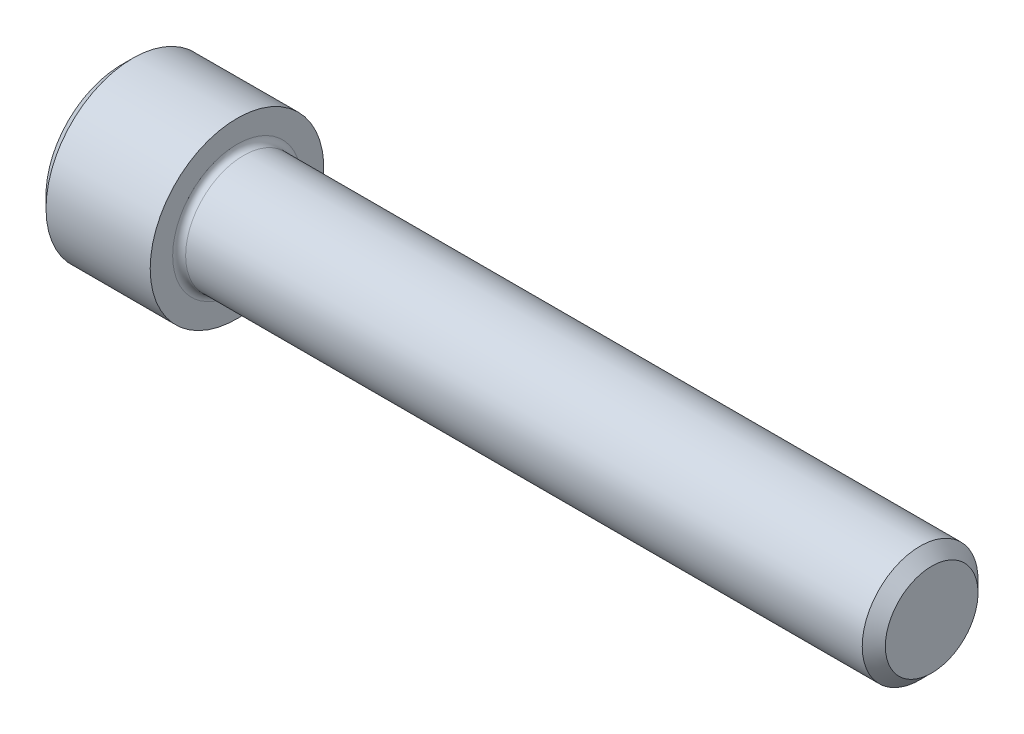
ISO-10303-21;
HEADER;
FILE_DESCRIPTION(('STEP AP214'),'2;1');
FILE_NAME('part.step','',(''),(''),'','','');
FILE_SCHEMA(('AUTOMOTIVE_DESIGN { 1 0 10303 214 1 1 1 1 }'));
ENDSEC;
DATA;
#1=APPLICATION_CONTEXT('core data for automotive mechanical design processes');
#2=APPLICATION_PROTOCOL_DEFINITION('international standard','automotive_design',2000,#1);
#3=PRODUCT_CONTEXT('',#1,'mechanical');
#4=PRODUCT('Part','Part','',(#3));
#5=PRODUCT_RELATED_PRODUCT_CATEGORY('part','',(#4));
#6=PRODUCT_DEFINITION_FORMATION('','',#4);
#7=PRODUCT_DEFINITION_CONTEXT('part definition',#1,'design');
#8=PRODUCT_DEFINITION('design','',#6,#7);
#9=PRODUCT_DEFINITION_SHAPE('','',#8);
#10=(LENGTH_UNIT() NAMED_UNIT(*) SI_UNIT(.MILLI.,.METRE.));
#11=(NAMED_UNIT(*) PLANE_ANGLE_UNIT() SI_UNIT($,.RADIAN.));
#12=(NAMED_UNIT(*) SI_UNIT($,.STERADIAN.) SOLID_ANGLE_UNIT());
#13=UNCERTAINTY_MEASURE_WITH_UNIT(LENGTH_MEASURE(1.E-05),#10,'distance_accuracy_value','');
#14=(GEOMETRIC_REPRESENTATION_CONTEXT(3) GLOBAL_UNCERTAINTY_ASSIGNED_CONTEXT((#13)) GLOBAL_UNIT_ASSIGNED_CONTEXT((#10,
#11,#12)) REPRESENTATION_CONTEXT('',''));
#15=CARTESIAN_POINT('',(0.,0.,0.));
#16=DIRECTION('',(0.,0.,1.));
#17=DIRECTION('',(1.,0.,0.));
#18=AXIS2_PLACEMENT_3D('',#15,#16,#17);
#19=CARTESIAN_POINT('',(3.048,4.12444598552338,-2.38125));
#20=DIRECTION('',(1.,0.,0.));
#21=DIRECTION('',(0.,0.,-1.));
#22=AXIS2_PLACEMENT_3D('',#19,#20,#21);
#23=PLANE('',#22);
#24=DIRECTION('',(0.,1.,0.));
#25=VECTOR('',#24,1.);
#26=CARTESIAN_POINT('',(3.048,4.12444598552338,2.38125));
#27=LINE('',#26,#25);
#28=CARTESIAN_POINT('',(3.04800000000343,0.,2.38124999992517));
#29=VERTEX_POINT('',#28);
#30=CARTESIAN_POINT('',(3.048,-1.37481532850779,2.38125));
#31=VERTEX_POINT('',#30);
#32=EDGE_CURVE('E95',#29,#31,#27,.F.);
#33=ORIENTED_EDGE('',*,*,#32,.F.);
#34=CARTESIAN_POINT('',(3.04799999996081,0.,0.));
#35=DIRECTION('',(-1.,0.,0.));
#36=DIRECTION('',(0.,-1.,0.));
#37=AXIS2_PLACEMENT_3D('',#34,#35,#36);
#38=CIRCLE('',#37,2.38124999992806);
#39=CARTESIAN_POINT('',(3.04799999998041,-2.06222299273054,1.19062499998202));
#40=VERTEX_POINT('',#39);
#41=EDGE_CURVE('E97',#29,#40,#38,.F.);
#42=ORIENTED_EDGE('',*,*,#41,.T.);
#43=DIRECTION('',(0.,-0.500000000000001,-0.866025403784438));
#44=VECTOR('',#43,1.);
#45=CARTESIAN_POINT('',(3.048,-1.37481532850779,2.38125));
#46=LINE('',#45,#44);
#47=EDGE_CURVE('E100',#31,#40,#46,.T.);
#48=ORIENTED_EDGE('',*,*,#47,.F.);
#49=EDGE_LOOP('',(#33,#42,#48));
#50=FACE_BOUND('',#49,.T.);
#51=ADVANCED_FACE('F16',(#50),#23,.F.);
#52=CARTESIAN_POINT('',(3.048,4.12444598552338,-2.38125));
#53=DIRECTION('',(1.,0.,0.));
#54=DIRECTION('',(0.,0.,-1.));
#55=AXIS2_PLACEMENT_3D('',#52,#53,#54);
#56=PLANE('',#55);
#57=DIRECTION('',(0.,-0.500000000000001,-0.866025403784438));
#58=VECTOR('',#57,1.);
#59=CARTESIAN_POINT('',(3.048,-2.06222299276169,1.190625));
#60=LINE('',#59,#58);
#61=CARTESIAN_POINT('',(3.048,-2.74963065701559,0.));
#62=VERTEX_POINT('',#61);
#63=EDGE_CURVE('E168',#40,#62,#60,.T.);
#64=ORIENTED_EDGE('',*,*,#63,.F.);
#65=CARTESIAN_POINT('',(3.04799999996081,0.,0.));
#66=DIRECTION('',(-1.,0.,0.));
#67=DIRECTION('',(0.,-1.,0.));
#68=AXIS2_PLACEMENT_3D('',#65,#66,#67);
#69=CIRCLE('',#68,2.38124999992806);
#70=CARTESIAN_POINT('',(3.04799999998041,-2.06222299273054,-1.19062499998201));
#71=VERTEX_POINT('',#70);
#72=EDGE_CURVE('E115',#40,#71,#69,.F.);
#73=ORIENTED_EDGE('',*,*,#72,.T.);
#74=DIRECTION('',(0.,0.499999999999998,-0.86602540378444));
#75=VECTOR('',#74,1.);
#76=CARTESIAN_POINT('',(3.048,-2.74963065701559,0.));
#77=LINE('',#76,#75);
#78=EDGE_CURVE('E164',#62,#71,#77,.T.);
#79=ORIENTED_EDGE('',*,*,#78,.F.);
#80=EDGE_LOOP('',(#64,#73,#79));
#81=FACE_BOUND('',#80,.T.);
#82=ADVANCED_FACE('F340',(#81),#56,.F.);
#83=CARTESIAN_POINT('',(3.048,4.12444598552338,-2.38125));
#84=DIRECTION('',(1.,0.,0.));
#85=DIRECTION('',(0.,0.,-1.));
#86=AXIS2_PLACEMENT_3D('',#83,#84,#85);
#87=PLANE('',#86);
#88=DIRECTION('',(0.,0.499999999999998,-0.86602540378444));
#89=VECTOR('',#88,1.);
#90=CARTESIAN_POINT('',(3.048,-2.06222299276169,-1.19062499999999));
#91=LINE('',#90,#89);
#92=CARTESIAN_POINT('',(3.048,-1.3748153285078,-2.38125));
#93=VERTEX_POINT('',#92);
#94=EDGE_CURVE('E160',#71,#93,#91,.T.);
#95=ORIENTED_EDGE('',*,*,#94,.F.);
#96=CARTESIAN_POINT('',(3.04799999996081,0.,0.));
#97=DIRECTION('',(-1.,0.,0.));
#98=DIRECTION('',(0.,-1.,0.));
#99=AXIS2_PLACEMENT_3D('',#96,#97,#98);
#100=CIRCLE('',#99,2.38124999992806);
#101=CARTESIAN_POINT('',(3.04800000000343,0.,-2.38124999992517));
#102=VERTEX_POINT('',#101);
#103=EDGE_CURVE('E217',#71,#102,#100,.F.);
#104=ORIENTED_EDGE('',*,*,#103,.T.);
#105=DIRECTION('',(0.,1.,0.));
#106=VECTOR('',#105,1.);
#107=CARTESIAN_POINT('',(3.048,4.12444598552338,-2.38125));
#108=LINE('',#107,#106);
#109=EDGE_CURVE('E156',#93,#102,#108,.T.);
#110=ORIENTED_EDGE('',*,*,#109,.F.);
#111=EDGE_LOOP('',(#95,#104,#110));
#112=FACE_BOUND('',#111,.T.);
#113=ADVANCED_FACE('F337',(#112),#87,.F.);
#114=CARTESIAN_POINT('',(3.048,4.12444598552338,-2.38125));
#115=DIRECTION('',(1.,0.,0.));
#116=DIRECTION('',(0.,0.,-1.));
#117=AXIS2_PLACEMENT_3D('',#114,#115,#116);
#118=PLANE('',#117);
#119=DIRECTION('',(0.,1.,0.));
#120=VECTOR('',#119,1.);
#121=CARTESIAN_POINT('',(3.048,4.12444598552338,-2.38125));
#122=LINE('',#121,#120);
#123=CARTESIAN_POINT('',(3.048,1.37481532850779,-2.38125));
#124=VERTEX_POINT('',#123);
#125=EDGE_CURVE('E152',#102,#124,#122,.T.);
#126=ORIENTED_EDGE('',*,*,#125,.F.);
#127=CARTESIAN_POINT('',(3.04799999996081,0.,0.));
#128=DIRECTION('',(-1.,0.,0.));
#129=DIRECTION('',(0.,-1.,0.));
#130=AXIS2_PLACEMENT_3D('',#127,#128,#129);
#131=CIRCLE('',#130,2.38124999992806);
#132=CARTESIAN_POINT('',(3.04799999998041,2.06222299273054,-1.19062499998202));
#133=VERTEX_POINT('',#132);
#134=EDGE_CURVE('E214',#102,#133,#131,.F.);
#135=ORIENTED_EDGE('',*,*,#134,.T.);
#136=DIRECTION('',(0.,0.500000000000001,0.866025403784438));
#137=VECTOR('',#136,1.);
#138=CARTESIAN_POINT('',(3.048,1.37481532850779,-2.38125));
#139=LINE('',#138,#137);
#140=EDGE_CURVE('E148',#124,#133,#139,.T.);
#141=ORIENTED_EDGE('',*,*,#140,.F.);
#142=EDGE_LOOP('',(#126,#135,#141));
#143=FACE_BOUND('',#142,.T.);
#144=ADVANCED_FACE('F333',(#143),#118,.F.);
#145=CARTESIAN_POINT('',(3.048,4.12444598552338,-2.38125));
#146=DIRECTION('',(1.,0.,0.));
#147=DIRECTION('',(0.,0.,-1.));
#148=AXIS2_PLACEMENT_3D('',#145,#146,#147);
#149=PLANE('',#148);
#150=DIRECTION('',(0.,0.500000000000001,0.866025403784438));
#151=VECTOR('',#150,1.);
#152=CARTESIAN_POINT('',(3.048,2.06222299276169,-1.190625));
#153=LINE('',#152,#151);
#154=CARTESIAN_POINT('',(3.048,2.74963065701559,0.));
#155=VERTEX_POINT('',#154);
#156=EDGE_CURVE('E144',#133,#155,#153,.T.);
#157=ORIENTED_EDGE('',*,*,#156,.F.);
#158=CARTESIAN_POINT('',(3.04799999996081,0.,0.));
#159=DIRECTION('',(-1.,0.,0.));
#160=DIRECTION('',(0.,-1.,0.));
#161=AXIS2_PLACEMENT_3D('',#158,#159,#160);
#162=CIRCLE('',#161,2.38124999992806);
#163=CARTESIAN_POINT('',(3.04799999998041,2.06222299273055,1.19062499998201));
#164=VERTEX_POINT('',#163);
#165=EDGE_CURVE('E123',#133,#164,#162,.F.);
#166=ORIENTED_EDGE('',*,*,#165,.T.);
#167=DIRECTION('',(0.,-0.499999999999998,0.86602540378444));
#168=VECTOR('',#167,1.);
#169=CARTESIAN_POINT('',(3.048,2.74963065701559,0.));
#170=LINE('',#169,#168);
#171=EDGE_CURVE('E116',#155,#164,#170,.T.);
#172=ORIENTED_EDGE('',*,*,#171,.F.);
#173=EDGE_LOOP('',(#157,#166,#172));
#174=FACE_BOUND('',#173,.T.);
#175=ADVANCED_FACE('F329',(#174),#149,.F.);
#176=CARTESIAN_POINT('',(3.04800000009209,0.,0.));
#177=DIRECTION('',(-1.,0.,0.));
#178=DIRECTION('',(0.,-1.,0.));
#179=AXIS2_PLACEMENT_3D('',#176,#177,#178);
#180=CONICAL_SURFACE('',#179,2.38124999970069,1.04719755108734);
#181=CARTESIAN_POINT('',(4.42281532832567,0.,2.27373675443232E-10));
#182=VERTEX_POINT('',#181);
#183=VERTEX_LOOP('',#182);
#184=FACE_BOUND('',#183,.T.);
#185=ORIENTED_EDGE('',*,*,#41,.F.);
#186=CARTESIAN_POINT('',(3.04799999996081,0.,0.));
#187=DIRECTION('',(-1.,0.,0.));
#188=DIRECTION('',(0.,-1.,0.));
#189=AXIS2_PLACEMENT_3D('',#186,#187,#188);
#190=CIRCLE('',#189,2.38124999992806);
#191=EDGE_CURVE('E111',#29,#164,#190,.T.);
#192=ORIENTED_EDGE('',*,*,#191,.T.);
#193=ORIENTED_EDGE('',*,*,#165,.F.);
#194=ORIENTED_EDGE('',*,*,#134,.F.);
#195=ORIENTED_EDGE('',*,*,#103,.F.);
#196=ORIENTED_EDGE('',*,*,#72,.F.);
#197=EDGE_LOOP('',(#185,#192,#193,#194,#195,#196));
#198=FACE_BOUND('',#197,.T.);
#199=ADVANCED_FACE('F109',(#184,#198),#180,.F.);
#200=CARTESIAN_POINT('',(3.048,4.12444598552338,-2.38125));
#201=DIRECTION('',(1.,0.,0.));
#202=DIRECTION('',(0.,0.,-1.));
#203=AXIS2_PLACEMENT_3D('',#200,#201,#202);
#204=PLANE('',#203);
#205=DIRECTION('',(0.,0.499999999999998,-0.86602540378444));
#206=VECTOR('',#205,1.);
#207=CARTESIAN_POINT('',(3.048,2.74963065701559,0.));
#208=LINE('',#207,#206);
#209=CARTESIAN_POINT('',(3.048,1.3748153285078,2.38125));
#210=VERTEX_POINT('',#209);
#211=EDGE_CURVE('E122',#164,#210,#208,.F.);
#212=ORIENTED_EDGE('',*,*,#211,.F.);
#213=ORIENTED_EDGE('',*,*,#191,.F.);
#214=DIRECTION('',(0.,-1.,0.));
#215=VECTOR('',#214,1.);
#216=CARTESIAN_POINT('',(3.048,-1.37481532850779,2.38125));
#217=LINE('',#216,#215);
#218=EDGE_CURVE('E120',#29,#210,#217,.F.);
#219=ORIENTED_EDGE('',*,*,#218,.T.);
#220=EDGE_LOOP('',(#212,#213,#219));
#221=FACE_BOUND('',#220,.T.);
#222=ADVANCED_FACE('F119',(#221),#204,.F.);
#223=CARTESIAN_POINT('',(3.048,2.74963065701559,0.));
#224=DIRECTION('',(0.,-0.86602540378444,-0.499999999999998));
#225=DIRECTION('',(0.,0.499999999999998,-0.86602540378444));
#226=AXIS2_PLACEMENT_3D('',#223,#224,#225);
#227=PLANE('',#226);
#228=ORIENTED_EDGE('',*,*,#211,.T.);
#229=DIRECTION('',(1.,0.,0.));
#230=VECTOR('',#229,1.);
#231=CARTESIAN_POINT('',(3.048,1.3748153285078,2.38125));
#232=LINE('',#231,#230);
#233=CARTESIAN_POINT('',(0.,1.3748153285078,2.38125));
#234=VERTEX_POINT('',#233);
#235=EDGE_CURVE('E128',#210,#234,#232,.F.);
#236=ORIENTED_EDGE('',*,*,#235,.T.);
#237=DIRECTION('',(0.,-0.499999999999998,0.86602540378444));
#238=VECTOR('',#237,1.);
#239=CARTESIAN_POINT('',(0.,2.74963065701559,0.));
#240=LINE('',#239,#238);
#241=CARTESIAN_POINT('',(0.,2.74963065701559,0.));
#242=VERTEX_POINT('',#241);
#243=EDGE_CURVE('E135',#242,#234,#240,.T.);
#244=ORIENTED_EDGE('',*,*,#243,.F.);
#245=DIRECTION('',(1.,0.,0.));
#246=VECTOR('',#245,1.);
#247=CARTESIAN_POINT('',(3.048,2.74963065701559,0.));
#248=LINE('',#247,#246);
#249=EDGE_CURVE('E179',#242,#155,#248,.T.);
#250=ORIENTED_EDGE('',*,*,#249,.T.);
#251=ORIENTED_EDGE('',*,*,#171,.T.);
#252=EDGE_LOOP('',(#228,#236,#244,#250,#251));
#253=FACE_BOUND('',#252,.T.);
#254=ADVANCED_FACE('F321',(#253),#227,.T.);
#255=CARTESIAN_POINT('',(3.048,-1.37481532850779,2.38125));
#256=DIRECTION('',(0.,0.,1.));
#257=DIRECTION('',(0.,-1.,0.));
#258=AXIS2_PLACEMENT_3D('',#255,#256,#257);
#259=PLANE('',#258);
#260=ORIENTED_EDGE('',*,*,#235,.F.);
#261=ORIENTED_EDGE('',*,*,#218,.F.);
#262=ORIENTED_EDGE('',*,*,#32,.T.);
#263=DIRECTION('',(1.,0.,0.));
#264=VECTOR('',#263,1.);
#265=CARTESIAN_POINT('',(3.048,-1.37481532850779,2.38125));
#266=LINE('',#265,#264);
#267=CARTESIAN_POINT('',(0.,-1.37481532850779,2.38125));
#268=VERTEX_POINT('',#267);
#269=EDGE_CURVE('E130',#268,#31,#266,.T.);
#270=ORIENTED_EDGE('',*,*,#269,.F.);
#271=DIRECTION('',(0.,1.,0.));
#272=VECTOR('',#271,1.);
#273=CARTESIAN_POINT('',(0.,0.,2.38125));
#274=LINE('',#273,#272);
#275=EDGE_CURVE('E364',#234,#268,#274,.F.);
#276=ORIENTED_EDGE('',*,*,#275,.F.);
#277=EDGE_LOOP('',(#260,#261,#262,#270,#276));
#278=FACE_BOUND('',#277,.T.);
#279=ADVANCED_FACE('F126',(#278),#259,.F.);
#280=CARTESIAN_POINT('',(3.048,-1.37481532850779,2.38125));
#281=DIRECTION('',(0.,0.866025403784438,-0.500000000000001));
#282=DIRECTION('',(0.,0.500000000000001,0.866025403784438));
#283=AXIS2_PLACEMENT_3D('',#280,#281,#282);
#284=PLANE('',#283);
#285=ORIENTED_EDGE('',*,*,#63,.T.);
#286=DIRECTION('',(1.,0.,0.));
#287=VECTOR('',#286,1.);
#288=CARTESIAN_POINT('',(3.048,-2.74963065701559,0.));
#289=LINE('',#288,#287);
#290=CARTESIAN_POINT('',(0.,-2.74963065701559,0.));
#291=VERTEX_POINT('',#290);
#292=EDGE_CURVE('E190',#291,#62,#289,.T.);
#293=ORIENTED_EDGE('',*,*,#292,.F.);
#294=DIRECTION('',(0.,-0.500000000000001,-0.866025403784438));
#295=VECTOR('',#294,1.);
#296=CARTESIAN_POINT('',(0.,-1.37481532850779,2.38125));
#297=LINE('',#296,#295);
#298=EDGE_CURVE('E360',#268,#291,#297,.T.);
#299=ORIENTED_EDGE('',*,*,#298,.F.);
#300=ORIENTED_EDGE('',*,*,#269,.T.);
#301=ORIENTED_EDGE('',*,*,#47,.T.);
#302=EDGE_LOOP('',(#285,#293,#299,#300,#301));
#303=FACE_BOUND('',#302,.T.);
#304=ADVANCED_FACE('F314',(#303),#284,.T.);
#305=CARTESIAN_POINT('',(3.048,-2.74963065701559,0.));
#306=DIRECTION('',(0.,0.86602540378444,0.499999999999998));
#307=DIRECTION('',(0.,-0.499999999999998,0.86602540378444));
#308=AXIS2_PLACEMENT_3D('',#305,#306,#307);
#309=PLANE('',#308);
#310=ORIENTED_EDGE('',*,*,#94,.T.);
#311=DIRECTION('',(1.,0.,0.));
#312=VECTOR('',#311,1.);
#313=CARTESIAN_POINT('',(3.048,-1.3748153285078,-2.38125));
#314=LINE('',#313,#312);
#315=CARTESIAN_POINT('',(0.,-1.3748153285078,-2.38125));
#316=VERTEX_POINT('',#315);
#317=EDGE_CURVE('E183',#93,#316,#314,.F.);
#318=ORIENTED_EDGE('',*,*,#317,.T.);
#319=DIRECTION('',(0.,0.499999999999998,-0.86602540378444));
#320=VECTOR('',#319,1.);
#321=CARTESIAN_POINT('',(0.,-2.74963065701559,0.));
#322=LINE('',#321,#320);
#323=EDGE_CURVE('E353',#291,#316,#322,.T.);
#324=ORIENTED_EDGE('',*,*,#323,.F.);
#325=ORIENTED_EDGE('',*,*,#292,.T.);
#326=ORIENTED_EDGE('',*,*,#78,.T.);
#327=EDGE_LOOP('',(#310,#318,#324,#325,#326));
#328=FACE_BOUND('',#327,.T.);
#329=ADVANCED_FACE('F310',(#328),#309,.T.);
#330=CARTESIAN_POINT('',(3.048,1.37481532850779,-2.38125));
#331=DIRECTION('',(0.,0.,-1.));
#332=DIRECTION('',(0.,1.,0.));
#333=AXIS2_PLACEMENT_3D('',#330,#331,#332);
#334=PLANE('',#333);
#335=ORIENTED_EDGE('',*,*,#317,.F.);
#336=ORIENTED_EDGE('',*,*,#109,.T.);
#337=ORIENTED_EDGE('',*,*,#125,.T.);
#338=DIRECTION('',(1.,0.,0.));
#339=VECTOR('',#338,1.);
#340=CARTESIAN_POINT('',(3.048,1.37481532850779,-2.38125));
#341=LINE('',#340,#339);
#342=CARTESIAN_POINT('',(0.,1.37481532850779,-2.38125));
#343=VERTEX_POINT('',#342);
#344=EDGE_CURVE('E182',#124,#343,#341,.F.);
#345=ORIENTED_EDGE('',*,*,#344,.T.);
#346=DIRECTION('',(0.,1.,0.));
#347=VECTOR('',#346,1.);
#348=CARTESIAN_POINT('',(0.,0.,-2.38125));
#349=LINE('',#348,#347);
#350=EDGE_CURVE('E359',#316,#343,#349,.T.);
#351=ORIENTED_EDGE('',*,*,#350,.F.);
#352=EDGE_LOOP('',(#335,#336,#337,#345,#351));
#353=FACE_BOUND('',#352,.T.);
#354=ADVANCED_FACE('F306',(#353),#334,.F.);
#355=CARTESIAN_POINT('',(3.048,2.74963065701559,0.));
#356=DIRECTION('',(0.,0.866025403784438,-0.500000000000001));
#357=DIRECTION('',(0.,0.500000000000001,0.866025403784438));
#358=AXIS2_PLACEMENT_3D('',#355,#356,#357);
#359=PLANE('',#358);
#360=ORIENTED_EDGE('',*,*,#344,.F.);
#361=ORIENTED_EDGE('',*,*,#140,.T.);
#362=ORIENTED_EDGE('',*,*,#156,.T.);
#363=ORIENTED_EDGE('',*,*,#249,.F.);
#364=DIRECTION('',(0.,0.500000000000001,0.866025403784438));
#365=VECTOR('',#364,1.);
#366=CARTESIAN_POINT('',(0.,1.37481532850779,-2.38125));
#367=LINE('',#366,#365);
#368=EDGE_CURVE('E210',#343,#242,#367,.T.);
#369=ORIENTED_EDGE('',*,*,#368,.F.);
#370=EDGE_LOOP('',(#360,#361,#362,#363,#369));
#371=FACE_BOUND('',#370,.T.);
#372=ADVANCED_FACE('F302',(#371),#359,.F.);
#373=CARTESIAN_POINT('',(0.,0.,0.));
#374=DIRECTION('',(-1.,0.,0.));
#375=DIRECTION('',(0.,0.,1.));
#376=AXIS2_PLACEMENT_3D('',#373,#374,#375);
#377=PLANE('',#376);
#378=CARTESIAN_POINT('',(0.,0.,0.));
#379=DIRECTION('',(1.,0.,0.));
#380=DIRECTION('',(0.,0.,-1.));
#381=AXIS2_PLACEMENT_3D('',#378,#379,#380);
#382=CIRCLE('',#381,4.1275000000951);
#383=CARTESIAN_POINT('',(0.,0.,-4.1275000000951));
#384=VERTEX_POINT('',#383);
#385=EDGE_CURVE('E208',#384,#384,#382,.T.);
#386=ORIENTED_EDGE('',*,*,#385,.F.);
#387=EDGE_LOOP('',(#386));
#388=FACE_BOUND('',#387,.T.);
#389=ORIENTED_EDGE('',*,*,#350,.T.);
#390=ORIENTED_EDGE('',*,*,#368,.T.);
#391=ORIENTED_EDGE('',*,*,#243,.T.);
#392=ORIENTED_EDGE('',*,*,#275,.T.);
#393=ORIENTED_EDGE('',*,*,#298,.T.);
#394=ORIENTED_EDGE('',*,*,#323,.T.);
#395=EDGE_LOOP('',(#389,#390,#391,#392,#393,#394));
#396=FACE_BOUND('',#395,.T.);
#397=ADVANCED_FACE('F294',(#388,#396),#377,.T.);
#398=CARTESIAN_POINT('',(0.634999999874708,0.,0.));
#399=DIRECTION('',(1.,0.,0.));
#400=DIRECTION('',(0.,0.,-1.));
#401=AXIS2_PLACEMENT_3D('',#398,#399,#400);
#402=CONICAL_SURFACE('',#401,4.7624999999698,0.785398163397448);
#403=ORIENTED_EDGE('',*,*,#385,.T.);
#404=EDGE_LOOP('',(#403));
#405=FACE_BOUND('',#404,.T.);
#406=CARTESIAN_POINT('',(0.635000000000004,0.,0.));
#407=DIRECTION('',(-1.,0.,0.));
#408=DIRECTION('',(0.,0.,1.));
#409=AXIS2_PLACEMENT_3D('',#406,#407,#408);
#410=CIRCLE('',#409,4.7625);
#411=CARTESIAN_POINT('',(0.635000000000004,0.,4.7625));
#412=VERTEX_POINT('',#411);
#413=EDGE_CURVE('E207',#412,#412,#410,.F.);
#414=ORIENTED_EDGE('',*,*,#413,.F.);
#415=EDGE_LOOP('',(#414));
#416=FACE_BOUND('',#415,.T.);
#417=ADVANCED_FACE('F289',(#405,#416),#402,.T.);
#418=CARTESIAN_POINT('',(-31.75,0.,0.));
#419=DIRECTION('',(-1.,0.,0.));
#420=DIRECTION('',(0.,0.,1.));
#421=AXIS2_PLACEMENT_3D('',#418,#419,#420);
#422=CYLINDRICAL_SURFACE('',#421,4.7625);
#423=CARTESIAN_POINT('',(6.35,0.,0.));
#424=DIRECTION('',(-1.,0.,0.));
#425=DIRECTION('',(0.,0.,1.));
#426=AXIS2_PLACEMENT_3D('',#423,#424,#425);
#427=CIRCLE('',#426,4.7625);
#428=CARTESIAN_POINT('',(6.35,0.,4.7625));
#429=VERTEX_POINT('',#428);
#430=EDGE_CURVE('E204',#429,#429,#427,.F.);
#431=ORIENTED_EDGE('',*,*,#430,.F.);
#432=EDGE_LOOP('',(#431));
#433=FACE_BOUND('',#432,.T.);
#434=ORIENTED_EDGE('',*,*,#413,.T.);
#435=EDGE_LOOP('',(#434));
#436=FACE_BOUND('',#435,.T.);
#437=ADVANCED_FACE('F285',(#433,#436),#422,.T.);
#438=CARTESIAN_POINT('',(44.45,0.,0.));
#439=DIRECTION('',(1.,0.,0.));
#440=DIRECTION('',(0.,0.,-1.));
#441=AXIS2_PLACEMENT_3D('',#438,#439,#440);
#442=PLANE('',#441);
#443=CARTESIAN_POINT('',(44.4500000000403,0.,0.));
#444=DIRECTION('',(-1.,0.,0.));
#445=DIRECTION('',(0.,0.,1.));
#446=AXIS2_PLACEMENT_3D('',#443,#444,#445);
#447=CIRCLE('',#446,2.53999999995358);
#448=CARTESIAN_POINT('',(44.4500000000403,0.,2.53999999995358));
#449=VERTEX_POINT('',#448);
#450=EDGE_CURVE('E200',#449,#449,#447,.T.);
#451=ORIENTED_EDGE('',*,*,#450,.F.);
#452=EDGE_LOOP('',(#451));
#453=FACE_BOUND('',#452,.T.);
#454=ADVANCED_FACE('F243',(#453),#442,.T.);
#455=CARTESIAN_POINT('',(6.35,4.7625,0.));
#456=DIRECTION('',(1.,0.,0.));
#457=DIRECTION('',(0.,0.,-1.));
#458=AXIS2_PLACEMENT_3D('',#455,#456,#457);
#459=PLANE('',#458);
#460=ORIENTED_EDGE('',*,*,#430,.T.);
#461=EDGE_LOOP('',(#460));
#462=FACE_BOUND('',#461,.T.);
#463=CARTESIAN_POINT('',(6.35,0.,0.));
#464=DIRECTION('',(1.,0.,0.));
#465=DIRECTION('',(0.,0.,1.));
#466=AXIS2_PLACEMENT_3D('',#463,#464,#465);
#467=CIRCLE('',#466,3.53059999999999);
#468=CARTESIAN_POINT('',(6.35,0.,-3.53059999999999));
#469=VERTEX_POINT('',#468);
#470=CARTESIAN_POINT('',(6.35,0.,3.53059999999999));
#471=VERTEX_POINT('',#470);
#472=EDGE_CURVE('E203',#469,#471,#467,.F.);
#473=ORIENTED_EDGE('',*,*,#472,.T.);
#474=CARTESIAN_POINT('',(6.35,0.,0.));
#475=DIRECTION('',(1.,0.,0.));
#476=DIRECTION('',(0.,0.,-1.));
#477=AXIS2_PLACEMENT_3D('',#474,#475,#476);
#478=CIRCLE('',#477,3.53059999999999);
#479=EDGE_CURVE('E35',#471,#469,#478,.F.);
#480=ORIENTED_EDGE('',*,*,#479,.T.);
#481=EDGE_LOOP('',(#473,#480));
#482=FACE_BOUND('',#481,.T.);
#483=ADVANCED_FACE('F224',(#462,#482),#459,.T.);
#484=CARTESIAN_POINT('',(43.8149999999951,0.,0.));
#485=DIRECTION('',(-1.,0.,0.));
#486=DIRECTION('',(0.,0.,1.));
#487=AXIS2_PLACEMENT_3D('',#484,#485,#486);
#488=CONICAL_SURFACE('',#487,3.17499999999882,0.785398163397448);
#489=CARTESIAN_POINT('',(43.815,0.,0.));
#490=DIRECTION('',(-1.,0.,0.));
#491=DIRECTION('',(0.,0.,1.));
#492=AXIS2_PLACEMENT_3D('',#489,#490,#491);
#493=CIRCLE('',#492,3.17499999999999);
#494=CARTESIAN_POINT('',(43.815,0.,3.17499999999999));
#495=VERTEX_POINT('',#494);
#496=EDGE_CURVE('E27',#495,#495,#493,.T.);
#497=ORIENTED_EDGE('',*,*,#496,.F.);
#498=EDGE_LOOP('',(#497));
#499=FACE_BOUND('',#498,.T.);
#500=ORIENTED_EDGE('',*,*,#450,.T.);
#501=EDGE_LOOP('',(#500));
#502=FACE_BOUND('',#501,.T.);
#503=ADVANCED_FACE('F242',(#499,#502),#488,.T.);
#504=CARTESIAN_POINT('',(6.7056,0.,0.));
#505=DIRECTION('',(1.,0.,0.));
#506=DIRECTION('',(0.,0.,-1.));
#507=AXIS2_PLACEMENT_3D('',#504,#505,#506);
#508=TOROIDAL_SURFACE('',#507,3.53059999999999,0.3556);
#509=CARTESIAN_POINT('',(6.7056,0.,0.));
#510=DIRECTION('',(-1.,0.,0.));
#511=DIRECTION('',(0.,0.,1.));
#512=AXIS2_PLACEMENT_3D('',#509,#510,#511);
#513=CIRCLE('',#512,3.17499999999999);
#514=CARTESIAN_POINT('',(6.7056,0.,3.17499999999999));
#515=VERTEX_POINT('',#514);
#516=EDGE_CURVE('E11',#515,#515,#513,.F.);
#517=ORIENTED_EDGE('',*,*,#516,.F.);
#518=EDGE_LOOP('',(#517));
#519=FACE_BOUND('',#518,.T.);
#520=ORIENTED_EDGE('',*,*,#472,.F.);
#521=ORIENTED_EDGE('',*,*,#479,.F.);
#522=EDGE_LOOP('',(#520,#521));
#523=FACE_BOUND('',#522,.T.);
#524=ADVANCED_FACE('F221',(#519,#523),#508,.F.);
#525=CARTESIAN_POINT('',(-31.75,0.,0.));
#526=DIRECTION('',(-1.,0.,0.));
#527=DIRECTION('',(0.,0.,1.));
#528=AXIS2_PLACEMENT_3D('',#525,#526,#527);
#529=CYLINDRICAL_SURFACE('',#528,3.17499999999999);
#530=ORIENTED_EDGE('',*,*,#516,.T.);
#531=EDGE_LOOP('',(#530));
#532=FACE_BOUND('',#531,.T.);
#533=ORIENTED_EDGE('',*,*,#496,.T.);
#534=EDGE_LOOP('',(#533));
#535=FACE_BOUND('',#534,.T.);
#536=ADVANCED_FACE('F267',(#532,#535),#529,.T.);
#537=CLOSED_SHELL('',(#51,#82,#113,#144,#175,#199,#222,#254,#279,#304,#329,#354,#372,#397,#417,
#437,#454,#483,#503,#524,#536));
#538=MANIFOLD_SOLID_BREP('B1',#537);
#539=ADVANCED_BREP_SHAPE_REPRESENTATION('',(#18,#538),#14);
#540=SHAPE_DEFINITION_REPRESENTATION(#9,#539);
ENDSEC;
END-ISO-10303-21;
